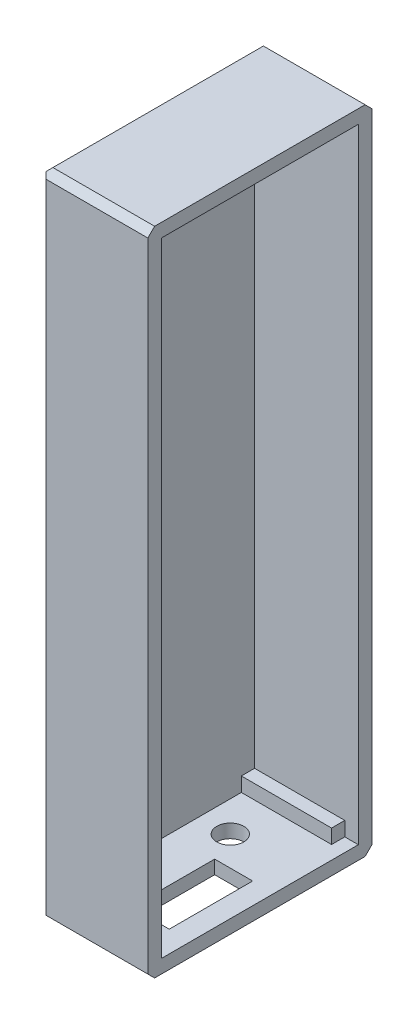
ISO-10303-21;
HEADER;
FILE_DESCRIPTION(('STEP AP214'),'2;1');
FILE_NAME('part.step','',(''),(''),'','','');
FILE_SCHEMA(('AUTOMOTIVE_DESIGN { 1 0 10303 214 1 1 1 1 }'));
ENDSEC;
DATA;
#1=APPLICATION_CONTEXT('core data for automotive mechanical design processes');
#2=APPLICATION_PROTOCOL_DEFINITION('international standard','automotive_design',2000,#1);
#3=PRODUCT_CONTEXT('',#1,'mechanical');
#4=PRODUCT('Part','Part','',(#3));
#5=PRODUCT_RELATED_PRODUCT_CATEGORY('part','',(#4));
#6=PRODUCT_DEFINITION_FORMATION('','',#4);
#7=PRODUCT_DEFINITION_CONTEXT('part definition',#1,'design');
#8=PRODUCT_DEFINITION('design','',#6,#7);
#9=PRODUCT_DEFINITION_SHAPE('','',#8);
#10=(LENGTH_UNIT() NAMED_UNIT(*) SI_UNIT(.MILLI.,.METRE.));
#11=(NAMED_UNIT(*) PLANE_ANGLE_UNIT() SI_UNIT($,.RADIAN.));
#12=(NAMED_UNIT(*) SI_UNIT($,.STERADIAN.) SOLID_ANGLE_UNIT());
#13=UNCERTAINTY_MEASURE_WITH_UNIT(LENGTH_MEASURE(1.E-05),#10,'distance_accuracy_value','');
#14=(GEOMETRIC_REPRESENTATION_CONTEXT(3) GLOBAL_UNCERTAINTY_ASSIGNED_CONTEXT((#13)) GLOBAL_UNIT_ASSIGNED_CONTEXT((#10,
#11,#12)) REPRESENTATION_CONTEXT('',''));
#15=CARTESIAN_POINT('',(0.,0.,0.));
#16=DIRECTION('',(0.,0.,1.));
#17=DIRECTION('',(1.,0.,0.));
#18=AXIS2_PLACEMENT_3D('',#15,#16,#17);
#19=CARTESIAN_POINT('',(-40.5,21.2128324188906,-18.7219563665642));
#20=DIRECTION('',(0.,0.,1.));
#21=DIRECTION('',(1.,0.,0.));
#22=AXIS2_PLACEMENT_3D('',#19,#20,#21);
#23=PLANE('',#22);
#24=DIRECTION('',(0.,1.,0.));
#25=VECTOR('',#24,1.);
#26=CARTESIAN_POINT('',(-26.5,98.4263697766396,-18.7219563665642));
#27=LINE('',#26,#25);
#28=CARTESIAN_POINT('',(-26.5,113.42636977664,-18.7219563665642));
#29=VERTEX_POINT('',#28);
#30=CARTESIAN_POINT('',(-26.5,115.212832418891,-18.7219563665642));
#31=VERTEX_POINT('',#30);
#32=EDGE_CURVE('E165',#29,#31,#27,.T.);
#33=ORIENTED_EDGE('',*,*,#32,.F.);
#34=DIRECTION('',(1.,0.,0.));
#35=VECTOR('',#34,1.);
#36=CARTESIAN_POINT('',(-39.5,113.42636977664,-18.7219563665642));
#37=LINE('',#36,#35);
#38=CARTESIAN_POINT('',(-39.7992713776096,113.42636977664,-18.7219563665642));
#39=VERTEX_POINT('',#38);
#40=EDGE_CURVE('E330',#39,#29,#37,.T.);
#41=ORIENTED_EDGE('',*,*,#40,.F.);
#42=DIRECTION('',(0.,-1.,0.));
#43=VECTOR('',#42,1.);
#44=CARTESIAN_POINT('',(-39.7992713776096,5.18456447563127,-18.7219563665642));
#45=LINE('',#44,#43);
#46=CARTESIAN_POINT('',(-39.7992713776096,25.3196112532839,-18.7219563665642));
#47=VERTEX_POINT('',#46);
#48=EDGE_CURVE('E263',#39,#47,#45,.T.);
#49=ORIENTED_EDGE('',*,*,#48,.T.);
#50=DIRECTION('',(1.,0.,0.));
#51=VECTOR('',#50,1.);
#52=CARTESIAN_POINT('',(-39.5,25.3196112532839,-18.7219563665642));
#53=LINE('',#52,#51);
#54=CARTESIAN_POINT('',(-26.5,25.3196112532839,-18.7219563665642));
#55=VERTEX_POINT('',#54);
#56=EDGE_CURVE('E270',#47,#55,#53,.T.);
#57=ORIENTED_EDGE('',*,*,#56,.T.);
#58=DIRECTION('',(0.,1.,0.));
#59=VECTOR('',#58,1.);
#60=CARTESIAN_POINT('',(-26.5,23.2128324188906,-18.7219563665642));
#61=LINE('',#60,#59);
#62=CARTESIAN_POINT('',(-26.5,23.2128324188906,-18.7219563665642));
#63=VERTEX_POINT('',#62);
#64=EDGE_CURVE('E484',#63,#55,#61,.T.);
#65=ORIENTED_EDGE('',*,*,#64,.F.);
#66=DIRECTION('',(1.,0.,0.));
#67=VECTOR('',#66,1.);
#68=CARTESIAN_POINT('',(-40.5,23.2128324188906,-18.7219563665642));
#69=LINE('',#68,#67);
#70=CARTESIAN_POINT('',(-24.5,23.2128324188906,-18.7219563665642));
#71=VERTEX_POINT('',#70);
#72=EDGE_CURVE('E431',#63,#71,#69,.T.);
#73=ORIENTED_EDGE('',*,*,#72,.T.);
#74=DIRECTION('',(0.,-1.,0.));
#75=VECTOR('',#74,1.);
#76=CARTESIAN_POINT('',(-24.5,5.18456447563127,-18.7219563665642));
#77=LINE('',#76,#75);
#78=CARTESIAN_POINT('',(-24.5,115.212832418891,-18.7219563665642));
#79=VERTEX_POINT('',#78);
#80=EDGE_CURVE('E381',#79,#71,#77,.T.);
#81=ORIENTED_EDGE('',*,*,#80,.F.);
#82=DIRECTION('',(1.,0.,0.));
#83=VECTOR('',#82,1.);
#84=CARTESIAN_POINT('',(-40.5,115.212832418891,-18.7219563665642));
#85=LINE('',#84,#83);
#86=EDGE_CURVE('E292',#31,#79,#85,.T.);
#87=ORIENTED_EDGE('',*,*,#86,.F.);
#88=EDGE_LOOP('',(#33,#41,#49,#57,#65,#73,#81,#87));
#89=FACE_BOUND('',#88,.T.);
#90=ADVANCED_FACE('F83',(#89),#23,.T.);
#91=CARTESIAN_POINT('',(-40.5,115.212832418891,-20.7219563665642));
#92=DIRECTION('',(0.,-1.,0.));
#93=DIRECTION('',(0.,0.,-1.));
#94=AXIS2_PLACEMENT_3D('',#91,#92,#93);
#95=PLANE('',#94);
#96=DIRECTION('',(0.,0.,1.));
#97=VECTOR('',#96,1.);
#98=CARTESIAN_POINT('',(-26.5,115.212832418891,-18.7219563665642));
#99=LINE('',#98,#97);
#100=CARTESIAN_POINT('',(-26.5,115.212832418891,-16.7734714231343));
#101=VERTEX_POINT('',#100);
#102=EDGE_CURVE('E299',#31,#101,#99,.T.);
#103=ORIENTED_EDGE('',*,*,#102,.F.);
#104=ORIENTED_EDGE('',*,*,#86,.T.);
#105=DIRECTION('',(0.,0.,-1.));
#106=VECTOR('',#105,1.);
#107=CARTESIAN_POINT('',(-24.5,115.212832418891,-4.2490717029152));
#108=LINE('',#107,#106);
#109=CARTESIAN_POINT('',(-24.5,115.212832418891,10.3180436334358));
#110=VERTEX_POINT('',#109);
#111=EDGE_CURVE('E266',#110,#79,#108,.T.);
#112=ORIENTED_EDGE('',*,*,#111,.F.);
#113=DIRECTION('',(1.,0.,0.));
#114=VECTOR('',#113,1.);
#115=CARTESIAN_POINT('',(-40.5,115.212832418891,10.3180436334358));
#116=LINE('',#115,#114);
#117=CARTESIAN_POINT('',(-26.5,115.212832418891,10.3180436334358));
#118=VERTEX_POINT('',#117);
#119=EDGE_CURVE('E343',#118,#110,#116,.T.);
#120=ORIENTED_EDGE('',*,*,#119,.F.);
#121=DIRECTION('',(0.,0.,1.));
#122=VECTOR('',#121,1.);
#123=CARTESIAN_POINT('',(-26.5,115.212832418891,10.3180436334358));
#124=LINE('',#123,#122);
#125=CARTESIAN_POINT('',(-26.5,115.212832418891,8.369558690006));
#126=VERTEX_POINT('',#125);
#127=EDGE_CURVE('E339',#126,#118,#124,.T.);
#128=ORIENTED_EDGE('',*,*,#127,.F.);
#129=DIRECTION('',(1.,0.,0.));
#130=VECTOR('',#129,1.);
#131=CARTESIAN_POINT('',(-39.5,115.212832418891,8.369558690006));
#132=LINE('',#131,#130);
#133=CARTESIAN_POINT('',(-39.7992713776096,115.212832418891,8.369558690006));
#134=VERTEX_POINT('',#133);
#135=EDGE_CURVE('E326',#134,#126,#132,.T.);
#136=ORIENTED_EDGE('',*,*,#135,.F.);
#137=DIRECTION('',(0.,0.,-1.));
#138=VECTOR('',#137,1.);
#139=CARTESIAN_POINT('',(-39.7992713776096,115.212832418891,-4.2490717029152));
#140=LINE('',#139,#138);
#141=CARTESIAN_POINT('',(-39.7992713776096,115.212832418891,-16.7734714231343));
#142=VERTEX_POINT('',#141);
#143=EDGE_CURVE('E285',#134,#142,#140,.T.);
#144=ORIENTED_EDGE('',*,*,#143,.T.);
#145=DIRECTION('',(1.,0.,0.));
#146=VECTOR('',#145,1.);
#147=CARTESIAN_POINT('',(-39.5,115.212832418891,-16.7734714231343));
#148=LINE('',#147,#146);
#149=EDGE_CURVE('E329',#142,#101,#148,.T.);
#150=ORIENTED_EDGE('',*,*,#149,.T.);
#151=EDGE_LOOP('',(#103,#104,#112,#120,#128,#136,#144,#150));
#152=FACE_BOUND('',#151,.T.);
#153=ADVANCED_FACE('F568',(#152),#95,.T.);
#154=CARTESIAN_POINT('',(-40.5,23.2128324188906,-20.7219563665642));
#155=DIRECTION('',(0.,1.,0.));
#156=DIRECTION('',(0.,0.,1.));
#157=AXIS2_PLACEMENT_3D('',#154,#155,#156);
#158=PLANE('',#157);
#159=DIRECTION('',(1.,0.,0.));
#160=VECTOR('',#159,1.);
#161=CARTESIAN_POINT('',(-42.364278762556,23.2128324188906,6.00519514922583));
#162=LINE('',#161,#160);
#163=CARTESIAN_POINT('',(-33.2588268817087,23.2128324188906,6.00519514922583));
#164=VERTEX_POINT('',#163);
#165=CARTESIAN_POINT('',(-27.6588268817087,23.2128324188906,6.00519514922583));
#166=VERTEX_POINT('',#165);
#167=EDGE_CURVE('E361',#164,#166,#162,.T.);
#168=ORIENTED_EDGE('',*,*,#167,.F.);
#169=DIRECTION('',(0.,0.,1.));
#170=VECTOR('',#169,1.);
#171=CARTESIAN_POINT('',(-33.2588268817087,23.2128324188906,-19.8403777599721));
#172=LINE('',#171,#170);
#173=CARTESIAN_POINT('',(-33.2588268817087,23.2128324188906,-6.29480485077417));
#174=VERTEX_POINT('',#173);
#175=EDGE_CURVE('E313',#174,#164,#172,.T.);
#176=ORIENTED_EDGE('',*,*,#175,.F.);
#177=DIRECTION('',(-1.,0.,0.));
#178=VECTOR('',#177,1.);
#179=CARTESIAN_POINT('',(-42.364278762556,23.2128324188906,-6.29480485077417));
#180=LINE('',#179,#178);
#181=CARTESIAN_POINT('',(-27.6588268817087,23.2128324188906,-6.29480485077417));
#182=VERTEX_POINT('',#181);
#183=EDGE_CURVE('E353',#182,#174,#180,.T.);
#184=ORIENTED_EDGE('',*,*,#183,.F.);
#185=DIRECTION('',(0.,0.,-1.));
#186=VECTOR('',#185,1.);
#187=CARTESIAN_POINT('',(-27.6588268817087,23.2128324188906,-19.8403777599721));
#188=LINE('',#187,#186);
#189=EDGE_CURVE('E359',#166,#182,#188,.T.);
#190=ORIENTED_EDGE('',*,*,#189,.F.);
#191=EDGE_LOOP('',(#168,#176,#184,#190));
#192=FACE_BOUND('',#191,.T.);
#193=CARTESIAN_POINT('',(-35.2935806759241,23.2128324188906,-10.6333919773061));
#194=DIRECTION('',(0.,1.,0.));
#195=DIRECTION('',(0.,0.,1.));
#196=AXIS2_PLACEMENT_3D('',#193,#194,#195);
#197=CIRCLE('',#196,2.);
#198=CARTESIAN_POINT('',(-35.2935806759241,23.2128324188906,-8.63339197730609));
#199=VERTEX_POINT('',#198);
#200=EDGE_CURVE('E380',#199,#199,#197,.T.);
#201=ORIENTED_EDGE('',*,*,#200,.F.);
#202=EDGE_LOOP('',(#201));
#203=FACE_BOUND('',#202,.T.);
#204=DIRECTION('',(0.,0.,-1.));
#205=VECTOR('',#204,1.);
#206=CARTESIAN_POINT('',(-26.5,23.2128324188906,-16.7734714231343));
#207=LINE('',#206,#205);
#208=CARTESIAN_POINT('',(-26.5,23.2128324188906,-16.7734714231343));
#209=VERTEX_POINT('',#208);
#210=EDGE_CURVE('E493',#209,#63,#207,.T.);
#211=ORIENTED_EDGE('',*,*,#210,.F.);
#212=DIRECTION('',(1.,0.,0.));
#213=VECTOR('',#212,1.);
#214=CARTESIAN_POINT('',(-39.5,23.2128324188906,-16.7734714231343));
#215=LINE('',#214,#213);
#216=CARTESIAN_POINT('',(-39.7992713776096,23.2128324188906,-16.7734714231343));
#217=VERTEX_POINT('',#216);
#218=EDGE_CURVE('E485',#217,#209,#215,.T.);
#219=ORIENTED_EDGE('',*,*,#218,.F.);
#220=DIRECTION('',(0.,0.,1.));
#221=VECTOR('',#220,1.);
#222=CARTESIAN_POINT('',(-39.7992713776096,23.2128324188906,-4.2490717029152));
#223=LINE('',#222,#221);
#224=CARTESIAN_POINT('',(-39.7992713776096,23.2128324188906,8.369558690006));
#225=VERTEX_POINT('',#224);
#226=EDGE_CURVE('E265',#217,#225,#223,.T.);
#227=ORIENTED_EDGE('',*,*,#226,.T.);
#228=DIRECTION('',(1.,0.,0.));
#229=VECTOR('',#228,1.);
#230=CARTESIAN_POINT('',(-39.5,23.2128324188906,8.369558690006));
#231=LINE('',#230,#229);
#232=CARTESIAN_POINT('',(-26.5,23.2128324188906,8.369558690006));
#233=VERTEX_POINT('',#232);
#234=EDGE_CURVE('E262',#225,#233,#231,.T.);
#235=ORIENTED_EDGE('',*,*,#234,.T.);
#236=DIRECTION('',(0.,0.,-1.));
#237=VECTOR('',#236,1.);
#238=CARTESIAN_POINT('',(-26.5,23.2128324188906,8.369558690006));
#239=LINE('',#238,#237);
#240=CARTESIAN_POINT('',(-26.5,23.2128324188906,10.3180436334358));
#241=VERTEX_POINT('',#240);
#242=EDGE_CURVE('E1010',#241,#233,#239,.T.);
#243=ORIENTED_EDGE('',*,*,#242,.F.);
#244=DIRECTION('',(1.,0.,0.));
#245=VECTOR('',#244,1.);
#246=CARTESIAN_POINT('',(-40.5,23.2128324188906,10.3180436334358));
#247=LINE('',#246,#245);
#248=CARTESIAN_POINT('',(-24.5,23.2128324188906,10.3180436334358));
#249=VERTEX_POINT('',#248);
#250=EDGE_CURVE('E346',#241,#249,#247,.T.);
#251=ORIENTED_EDGE('',*,*,#250,.T.);
#252=DIRECTION('',(0.,0.,1.));
#253=VECTOR('',#252,1.);
#254=CARTESIAN_POINT('',(-24.5,23.2128324188906,-4.2490717029152));
#255=LINE('',#254,#253);
#256=EDGE_CURVE('E438',#71,#249,#255,.T.);
#257=ORIENTED_EDGE('',*,*,#256,.F.);
#258=ORIENTED_EDGE('',*,*,#72,.F.);
#259=EDGE_LOOP('',(#211,#219,#227,#235,#243,#251,#257,#258));
#260=FACE_BOUND('',#259,.T.);
#261=ADVANCED_FACE('F509',(#192,#203,#260),#158,.T.);
#262=CARTESIAN_POINT('',(-24.5,5.18456447563127,-4.2490717029152));
#263=DIRECTION('',(1.,0.,0.));
#264=DIRECTION('',(0.,0.,-1.));
#265=AXIS2_PLACEMENT_3D('',#262,#263,#264);
#266=PLANE('',#265);
#267=DIRECTION('',(0.,0.,-1.));
#268=VECTOR('',#267,1.);
#269=CARTESIAN_POINT('',(-24.5,117.212832418891,-20.7219563665642));
#270=LINE('',#269,#268);
#271=CARTESIAN_POINT('',(-24.5,117.212832418891,11.3180436334358));
#272=VERTEX_POINT('',#271);
#273=CARTESIAN_POINT('',(-24.5,117.212832418891,-19.7219563665642));
#274=VERTEX_POINT('',#273);
#275=EDGE_CURVE('E310',#272,#274,#270,.T.);
#276=ORIENTED_EDGE('',*,*,#275,.F.);
#277=DIRECTION('',(0.,0.707106781186552,-0.707106781186543));
#278=VECTOR('',#277,1.);
#279=CARTESIAN_POINT('',(-24.5,68.9822561154357,59.5486199368901));
#280=LINE('',#279,#278);
#281=CARTESIAN_POINT('',(-24.5,116.212832418891,12.3180436334358));
#282=VERTEX_POINT('',#281);
#283=EDGE_CURVE('E388',#272,#282,#280,.F.);
#284=ORIENTED_EDGE('',*,*,#283,.T.);
#285=DIRECTION('',(0.,1.,0.));
#286=VECTOR('',#285,1.);
#287=CARTESIAN_POINT('',(-24.5,21.2128324188906,12.3180436334358));
#288=LINE('',#287,#286);
#289=CARTESIAN_POINT('',(-24.5,22.2128324188906,12.3180436334358));
#290=VERTEX_POINT('',#289);
#291=EDGE_CURVE('E314',#290,#282,#288,.T.);
#292=ORIENTED_EDGE('',*,*,#291,.F.);
#293=DIRECTION('',(0.,0.707106781186548,0.707106781186548));
#294=VECTOR('',#293,1.);
#295=CARTESIAN_POINT('',(-24.5,5.41514077908542,-4.47964800636934));
#296=LINE('',#295,#294);
#297=CARTESIAN_POINT('',(-24.5,21.2128324188906,11.3180436334358));
#298=VERTEX_POINT('',#297);
#299=EDGE_CURVE('E453',#290,#298,#296,.F.);
#300=ORIENTED_EDGE('',*,*,#299,.T.);
#301=DIRECTION('',(0.,0.,1.));
#302=VECTOR('',#301,1.);
#303=CARTESIAN_POINT('',(-24.5,21.2128324188906,-20.7219563665642));
#304=LINE('',#303,#302);
#305=CARTESIAN_POINT('',(-24.5,21.2128324188906,-19.7219563665642));
#306=VERTEX_POINT('',#305);
#307=EDGE_CURVE('E430',#306,#298,#304,.T.);
#308=ORIENTED_EDGE('',*,*,#307,.F.);
#309=DIRECTION('',(0.,-0.707106781186548,0.707106781186548));
#310=VECTOR('',#309,1.);
#311=CARTESIAN_POINT('',(-24.5,5.46225611543645,-3.97138006311002));
#312=LINE('',#311,#310);
#313=CARTESIAN_POINT('',(-24.5,22.2128324188906,-20.7219563665642));
#314=VERTEX_POINT('',#313);
#315=EDGE_CURVE('E429',#306,#314,#312,.F.);
#316=ORIENTED_EDGE('',*,*,#315,.T.);
#317=DIRECTION('',(0.,-1.,0.));
#318=VECTOR('',#317,1.);
#319=CARTESIAN_POINT('',(-24.5,21.2128324188906,-20.7219563665642));
#320=LINE('',#319,#318);
#321=CARTESIAN_POINT('',(-24.5,116.212832418891,-20.7219563665642));
#322=VERTEX_POINT('',#321);
#323=EDGE_CURVE('E425',#322,#314,#320,.T.);
#324=ORIENTED_EDGE('',*,*,#323,.F.);
#325=DIRECTION('',(0.,-0.707106781186552,-0.707106781186543));
#326=VECTOR('',#325,1.);
#327=CARTESIAN_POINT('',(-24.5,68.9351407790846,-67.9996480063694));
#328=LINE('',#327,#326);
#329=EDGE_CURVE('E249',#322,#274,#328,.F.);
#330=ORIENTED_EDGE('',*,*,#329,.T.);
#331=EDGE_LOOP('',(#276,#284,#292,#300,#308,#316,#324,#330));
#332=FACE_BOUND('',#331,.T.);
#333=ORIENTED_EDGE('',*,*,#111,.T.);
#334=ORIENTED_EDGE('',*,*,#80,.T.);
#335=ORIENTED_EDGE('',*,*,#256,.T.);
#336=DIRECTION('',(0.,1.,0.));
#337=VECTOR('',#336,1.);
#338=CARTESIAN_POINT('',(-24.5,5.18456447563127,10.3180436334358));
#339=LINE('',#338,#337);
#340=EDGE_CURVE('E349',#249,#110,#339,.T.);
#341=ORIENTED_EDGE('',*,*,#340,.T.);
#342=EDGE_LOOP('',(#333,#334,#335,#341));
#343=FACE_BOUND('',#342,.T.);
#344=ADVANCED_FACE('F420',(#332,#343),#266,.T.);
#345=CARTESIAN_POINT('',(-40.5,21.2128324188906,-20.7219563665642));
#346=DIRECTION('',(0.,0.,1.));
#347=DIRECTION('',(1.,0.,0.));
#348=AXIS2_PLACEMENT_3D('',#345,#346,#347);
#349=PLANE('',#348);
#350=DIRECTION('',(0.,1.,0.));
#351=VECTOR('',#350,1.);
#352=CARTESIAN_POINT('',(-39.5,21.2128324188906,-20.7219563665642));
#353=LINE('',#352,#351);
#354=CARTESIAN_POINT('',(-39.5,22.2128324188906,-20.7219563665642));
#355=VERTEX_POINT('',#354);
#356=CARTESIAN_POINT('',(-39.5,116.212832418891,-20.7219563665642));
#357=VERTEX_POINT('',#356);
#358=EDGE_CURVE('E229',#355,#357,#353,.T.);
#359=ORIENTED_EDGE('',*,*,#358,.T.);
#360=DIRECTION('',(1.,0.,0.));
#361=VECTOR('',#360,1.);
#362=CARTESIAN_POINT('',(-40.5,116.212832418891,-20.7219563665642));
#363=LINE('',#362,#361);
#364=EDGE_CURVE('E240',#357,#322,#363,.T.);
#365=ORIENTED_EDGE('',*,*,#364,.T.);
#366=ORIENTED_EDGE('',*,*,#323,.T.);
#367=DIRECTION('',(-1.,0.,0.));
#368=VECTOR('',#367,1.);
#369=CARTESIAN_POINT('',(-40.5,22.2128324188906,-20.7219563665642));
#370=LINE('',#369,#368);
#371=EDGE_CURVE('E243',#314,#355,#370,.T.);
#372=ORIENTED_EDGE('',*,*,#371,.T.);
#373=EDGE_LOOP('',(#359,#365,#366,#372));
#374=FACE_BOUND('',#373,.T.);
#375=ADVANCED_FACE('F238',(#374),#349,.F.);
#376=CARTESIAN_POINT('',(-40.5,21.2128324188906,-20.7219563665642));
#377=DIRECTION('',(0.,1.,0.));
#378=DIRECTION('',(0.,0.,1.));
#379=AXIS2_PLACEMENT_3D('',#376,#377,#378);
#380=PLANE('',#379);
#381=CARTESIAN_POINT('',(-35.2935806759241,21.2128324188906,-10.6333919773061));
#382=DIRECTION('',(0.,-1.,0.));
#383=DIRECTION('',(0.,0.,-1.));
#384=AXIS2_PLACEMENT_3D('',#381,#382,#383);
#385=CIRCLE('',#384,2.);
#386=CARTESIAN_POINT('',(-35.2935806759241,21.2128324188906,-12.6333919773061));
#387=VERTEX_POINT('',#386);
#388=EDGE_CURVE('E444',#387,#387,#385,.T.);
#389=ORIENTED_EDGE('',*,*,#388,.F.);
#390=EDGE_LOOP('',(#389));
#391=FACE_BOUND('',#390,.T.);
#392=DIRECTION('',(0.,0.,-1.));
#393=VECTOR('',#392,1.);
#394=CARTESIAN_POINT('',(-33.2588268817087,21.2128324188906,-4.73600073532048));
#395=LINE('',#394,#393);
#396=CARTESIAN_POINT('',(-33.2588268817087,21.2128324188906,6.00519514922583));
#397=VERTEX_POINT('',#396);
#398=CARTESIAN_POINT('',(-33.2588268817087,21.2128324188906,-6.29480485077417));
#399=VERTEX_POINT('',#398);
#400=EDGE_CURVE('E354',#397,#399,#395,.T.);
#401=ORIENTED_EDGE('',*,*,#400,.F.);
#402=DIRECTION('',(-1.,0.,0.));
#403=VECTOR('',#402,1.);
#404=CARTESIAN_POINT('',(-36.545606228137,21.2128324188906,6.00519514922583));
#405=LINE('',#404,#403);
#406=CARTESIAN_POINT('',(-27.6588268817087,21.2128324188906,6.00519514922583));
#407=VERTEX_POINT('',#406);
#408=EDGE_CURVE('E358',#407,#397,#405,.T.);
#409=ORIENTED_EDGE('',*,*,#408,.F.);
#410=DIRECTION('',(0.,0.,1.));
#411=VECTOR('',#410,1.);
#412=CARTESIAN_POINT('',(-27.6588268817087,21.2128324188906,3.46399926467952));
#413=LINE('',#412,#411);
#414=CARTESIAN_POINT('',(-27.6588268817087,21.2128324188906,-6.29480485077417));
#415=VERTEX_POINT('',#414);
#416=EDGE_CURVE('E362',#415,#407,#413,.T.);
#417=ORIENTED_EDGE('',*,*,#416,.F.);
#418=DIRECTION('',(1.,0.,0.));
#419=VECTOR('',#418,1.);
#420=CARTESIAN_POINT('',(-33.245606228137,21.2128324188906,-6.29480485077417));
#421=LINE('',#420,#419);
#422=EDGE_CURVE('E357',#399,#415,#421,.T.);
#423=ORIENTED_EDGE('',*,*,#422,.F.);
#424=EDGE_LOOP('',(#401,#409,#417,#423));
#425=FACE_BOUND('',#424,.T.);
#426=ORIENTED_EDGE('',*,*,#307,.T.);
#427=DIRECTION('',(-1.,0.,0.));
#428=VECTOR('',#427,1.);
#429=CARTESIAN_POINT('',(-40.5,21.2128324188906,11.3180436334358));
#430=LINE('',#429,#428);
#431=CARTESIAN_POINT('',(-39.5,21.2128324188906,11.3180436334358));
#432=VERTEX_POINT('',#431);
#433=EDGE_CURVE('E244',#298,#432,#430,.T.);
#434=ORIENTED_EDGE('',*,*,#433,.T.);
#435=DIRECTION('',(0.,0.,-1.));
#436=VECTOR('',#435,1.);
#437=CARTESIAN_POINT('',(-39.5,21.2128324188906,-20.7219563665642));
#438=LINE('',#437,#436);
#439=CARTESIAN_POINT('',(-39.5,21.2128324188906,-19.7219563665642));
#440=VERTEX_POINT('',#439);
#441=EDGE_CURVE('E459',#432,#440,#438,.T.);
#442=ORIENTED_EDGE('',*,*,#441,.T.);
#443=DIRECTION('',(1.,0.,0.));
#444=VECTOR('',#443,1.);
#445=CARTESIAN_POINT('',(-40.5,21.2128324188906,-19.7219563665642));
#446=LINE('',#445,#444);
#447=EDGE_CURVE('E456',#440,#306,#446,.T.);
#448=ORIENTED_EDGE('',*,*,#447,.T.);
#449=EDGE_LOOP('',(#426,#434,#442,#448));
#450=FACE_BOUND('',#449,.T.);
#451=ADVANCED_FACE('F626',(#391,#425,#450),#380,.F.);
#452=CARTESIAN_POINT('',(-40.5,21.2128324188906,12.3180436334358));
#453=DIRECTION('',(0.,0.,-1.));
#454=DIRECTION('',(-1.,0.,0.));
#455=AXIS2_PLACEMENT_3D('',#452,#453,#454);
#456=PLANE('',#455);
#457=ORIENTED_EDGE('',*,*,#291,.T.);
#458=DIRECTION('',(-1.,0.,0.));
#459=VECTOR('',#458,1.);
#460=CARTESIAN_POINT('',(-40.5,116.212832418891,12.3180436334358));
#461=LINE('',#460,#459);
#462=CARTESIAN_POINT('',(-39.5,116.212832418891,12.3180436334358));
#463=VERTEX_POINT('',#462);
#464=EDGE_CURVE('E390',#282,#463,#461,.T.);
#465=ORIENTED_EDGE('',*,*,#464,.T.);
#466=DIRECTION('',(0.,-1.,0.));
#467=VECTOR('',#466,1.);
#468=CARTESIAN_POINT('',(-39.5,21.2128324188906,12.3180436334358));
#469=LINE('',#468,#467);
#470=CARTESIAN_POINT('',(-39.5,22.2128324188906,12.3180436334358));
#471=VERTEX_POINT('',#470);
#472=EDGE_CURVE('E449',#463,#471,#469,.T.);
#473=ORIENTED_EDGE('',*,*,#472,.T.);
#474=DIRECTION('',(1.,0.,0.));
#475=VECTOR('',#474,1.);
#476=CARTESIAN_POINT('',(-40.5,22.2128324188906,12.3180436334358));
#477=LINE('',#476,#475);
#478=EDGE_CURVE('E411',#471,#290,#477,.T.);
#479=ORIENTED_EDGE('',*,*,#478,.T.);
#480=EDGE_LOOP('',(#457,#465,#473,#479));
#481=FACE_BOUND('',#480,.T.);
#482=ADVANCED_FACE('F623',(#481),#456,.F.);
#483=CARTESIAN_POINT('',(-40.5,117.212832418891,-20.7219563665642));
#484=DIRECTION('',(0.,-1.,0.));
#485=DIRECTION('',(0.,0.,-1.));
#486=AXIS2_PLACEMENT_3D('',#483,#484,#485);
#487=PLANE('',#486);
#488=DIRECTION('',(0.,0.,1.));
#489=VECTOR('',#488,1.);
#490=CARTESIAN_POINT('',(-39.5,117.212832418891,-20.7219563665642));
#491=LINE('',#490,#489);
#492=CARTESIAN_POINT('',(-39.5,117.212832418891,-19.7219563665642));
#493=VERTEX_POINT('',#492);
#494=CARTESIAN_POINT('',(-39.5,117.212832418891,11.3180436334358));
#495=VERTEX_POINT('',#494);
#496=EDGE_CURVE('E293',#493,#495,#491,.T.);
#497=ORIENTED_EDGE('',*,*,#496,.T.);
#498=DIRECTION('',(1.,0.,0.));
#499=VECTOR('',#498,1.);
#500=CARTESIAN_POINT('',(-40.5,117.212832418891,11.3180436334358));
#501=LINE('',#500,#499);
#502=EDGE_CURVE('E384',#495,#272,#501,.T.);
#503=ORIENTED_EDGE('',*,*,#502,.T.);
#504=ORIENTED_EDGE('',*,*,#275,.T.);
#505=DIRECTION('',(-1.,0.,0.));
#506=VECTOR('',#505,1.);
#507=CARTESIAN_POINT('',(-40.5,117.212832418891,-19.7219563665642));
#508=LINE('',#507,#506);
#509=EDGE_CURVE('E297',#274,#493,#508,.T.);
#510=ORIENTED_EDGE('',*,*,#509,.T.);
#511=EDGE_LOOP('',(#497,#503,#504,#510));
#512=FACE_BOUND('',#511,.T.);
#513=ADVANCED_FACE('F416',(#512),#487,.F.);
#514=CARTESIAN_POINT('',(-40.5,5.18456447563127,-4.2490717029152));
#515=DIRECTION('',(1.,0.,0.));
#516=DIRECTION('',(0.,0.,-1.));
#517=AXIS2_PLACEMENT_3D('',#514,#515,#516);
#518=PLANE('',#517);
#519=DIRECTION('',(0.,1.,0.));
#520=VECTOR('',#519,1.);
#521=CARTESIAN_POINT('',(-40.5,5.18456447563127,11.3180436334358));
#522=LINE('',#521,#520);
#523=CARTESIAN_POINT('',(-40.5,22.2128324188906,11.3180436334358));
#524=VERTEX_POINT('',#523);
#525=CARTESIAN_POINT('',(-40.5,116.212832418891,11.3180436334358));
#526=VERTEX_POINT('',#525);
#527=EDGE_CURVE('E399',#524,#526,#522,.T.);
#528=ORIENTED_EDGE('',*,*,#527,.T.);
#529=DIRECTION('',(0.,0.,-1.));
#530=VECTOR('',#529,1.);
#531=CARTESIAN_POINT('',(-40.5,116.212832418891,-4.2490717029152));
#532=LINE('',#531,#530);
#533=CARTESIAN_POINT('',(-40.5,116.212832418891,-19.7219563665642));
#534=VERTEX_POINT('',#533);
#535=EDGE_CURVE('E12',#526,#534,#532,.T.);
#536=ORIENTED_EDGE('',*,*,#535,.T.);
#537=DIRECTION('',(0.,-1.,0.));
#538=VECTOR('',#537,1.);
#539=CARTESIAN_POINT('',(-40.5,5.18456447563127,-19.7219563665642));
#540=LINE('',#539,#538);
#541=CARTESIAN_POINT('',(-40.5,22.2128324188906,-19.7219563665642));
#542=VERTEX_POINT('',#541);
#543=EDGE_CURVE('E376',#534,#542,#540,.T.);
#544=ORIENTED_EDGE('',*,*,#543,.T.);
#545=DIRECTION('',(0.,0.,1.));
#546=VECTOR('',#545,1.);
#547=CARTESIAN_POINT('',(-40.5,22.2128324188906,-4.2490717029152));
#548=LINE('',#547,#546);
#549=EDGE_CURVE('E409',#542,#524,#548,.T.);
#550=ORIENTED_EDGE('',*,*,#549,.T.);
#551=EDGE_LOOP('',(#528,#536,#544,#550));
#552=FACE_BOUND('',#551,.T.);
#553=ADVANCED_FACE('F406',(#552),#518,.F.);
#554=CARTESIAN_POINT('',(-40.5,21.2128324188906,10.3180436334358));
#555=DIRECTION('',(0.,0.,-1.));
#556=DIRECTION('',(-1.,0.,0.));
#557=AXIS2_PLACEMENT_3D('',#554,#555,#556);
#558=PLANE('',#557);
#559=DIRECTION('',(0.,-1.,0.));
#560=VECTOR('',#559,1.);
#561=CARTESIAN_POINT('',(-26.5,23.2128324188906,10.3180436334358));
#562=LINE('',#561,#560);
#563=CARTESIAN_POINT('',(-26.5,25.3196112532839,10.3180436334358));
#564=VERTEX_POINT('',#563);
#565=EDGE_CURVE('E1014',#564,#241,#562,.T.);
#566=ORIENTED_EDGE('',*,*,#565,.F.);
#567=DIRECTION('',(1.,0.,0.));
#568=VECTOR('',#567,1.);
#569=CARTESIAN_POINT('',(-39.5,25.3196112532839,10.3180436334358));
#570=LINE('',#569,#568);
#571=CARTESIAN_POINT('',(-39.7992713776096,25.3196112532839,10.3180436334358));
#572=VERTEX_POINT('',#571);
#573=EDGE_CURVE('E1022',#572,#564,#570,.T.);
#574=ORIENTED_EDGE('',*,*,#573,.F.);
#575=DIRECTION('',(0.,1.,0.));
#576=VECTOR('',#575,1.);
#577=CARTESIAN_POINT('',(-39.7992713776096,5.18456447563127,10.3180436334358));
#578=LINE('',#577,#576);
#579=CARTESIAN_POINT('',(-39.7992713776096,113.42636977664,10.3180436334358));
#580=VERTEX_POINT('',#579);
#581=EDGE_CURVE('E277',#572,#580,#578,.T.);
#582=ORIENTED_EDGE('',*,*,#581,.T.);
#583=DIRECTION('',(1.,0.,0.));
#584=VECTOR('',#583,1.);
#585=CARTESIAN_POINT('',(-39.5,113.42636977664,10.3180436334358));
#586=LINE('',#585,#584);
#587=CARTESIAN_POINT('',(-26.5,113.42636977664,10.3180436334358));
#588=VERTEX_POINT('',#587);
#589=EDGE_CURVE('E315',#580,#588,#586,.T.);
#590=ORIENTED_EDGE('',*,*,#589,.T.);
#591=DIRECTION('',(0.,-1.,0.));
#592=VECTOR('',#591,1.);
#593=CARTESIAN_POINT('',(-26.5,98.4263697766396,10.3180436334358));
#594=LINE('',#593,#592);
#595=EDGE_CURVE('E323',#118,#588,#594,.T.);
#596=ORIENTED_EDGE('',*,*,#595,.F.);
#597=ORIENTED_EDGE('',*,*,#119,.T.);
#598=ORIENTED_EDGE('',*,*,#340,.F.);
#599=ORIENTED_EDGE('',*,*,#250,.F.);
#600=EDGE_LOOP('',(#566,#574,#582,#590,#596,#597,#598,#599));
#601=FACE_BOUND('',#600,.T.);
#602=ADVANCED_FACE('F560',(#601),#558,.T.);
#603=CARTESIAN_POINT('',(-39.7992713776096,5.18456447563127,-4.2490717029152));
#604=DIRECTION('',(1.,0.,0.));
#605=DIRECTION('',(0.,0.,-1.));
#606=AXIS2_PLACEMENT_3D('',#603,#604,#605);
#607=PLANE('',#606);
#608=ORIENTED_EDGE('',*,*,#48,.F.);
#609=DIRECTION('',(0.,0.,1.));
#610=VECTOR('',#609,1.);
#611=CARTESIAN_POINT('',(-39.7992713776096,113.42636977664,-18.7219563665642));
#612=LINE('',#611,#610);
#613=CARTESIAN_POINT('',(-39.7992713776096,113.42636977664,-16.7734714231343));
#614=VERTEX_POINT('',#613);
#615=EDGE_CURVE('E87',#39,#614,#612,.T.);
#616=ORIENTED_EDGE('',*,*,#615,.T.);
#617=DIRECTION('',(0.,1.,0.));
#618=VECTOR('',#617,1.);
#619=CARTESIAN_POINT('',(-39.7992713776096,100.212832418891,-16.7734714231343));
#620=LINE('',#619,#618);
#621=EDGE_CURVE('E154',#614,#142,#620,.T.);
#622=ORIENTED_EDGE('',*,*,#621,.T.);
#623=ORIENTED_EDGE('',*,*,#143,.F.);
#624=DIRECTION('',(0.,1.,0.));
#625=VECTOR('',#624,1.);
#626=CARTESIAN_POINT('',(-39.7992713776096,5.18456447563127,8.369558690006));
#627=LINE('',#626,#625);
#628=CARTESIAN_POINT('',(-39.7992713776096,113.42636977664,8.369558690006));
#629=VERTEX_POINT('',#628);
#630=EDGE_CURVE('E283',#629,#134,#627,.T.);
#631=ORIENTED_EDGE('',*,*,#630,.F.);
#632=DIRECTION('',(0.,0.,-1.));
#633=VECTOR('',#632,1.);
#634=CARTESIAN_POINT('',(-39.7992713776096,113.42636977664,-4.2490717029152));
#635=LINE('',#634,#633);
#636=EDGE_CURVE('E286',#580,#629,#635,.T.);
#637=ORIENTED_EDGE('',*,*,#636,.F.);
#638=ORIENTED_EDGE('',*,*,#581,.F.);
#639=DIRECTION('',(0.,0.,1.));
#640=VECTOR('',#639,1.);
#641=CARTESIAN_POINT('',(-39.7992713776096,25.3196112532839,-4.24907170291516));
#642=LINE('',#641,#640);
#643=CARTESIAN_POINT('',(-39.7992713776096,25.3196112532839,8.369558690006));
#644=VERTEX_POINT('',#643);
#645=EDGE_CURVE('E280',#644,#572,#642,.T.);
#646=ORIENTED_EDGE('',*,*,#645,.F.);
#647=DIRECTION('',(0.,1.,0.));
#648=VECTOR('',#647,1.);
#649=CARTESIAN_POINT('',(-39.7992713776096,5.18456447563127,8.369558690006));
#650=LINE('',#649,#648);
#651=EDGE_CURVE('E271',#225,#644,#650,.T.);
#652=ORIENTED_EDGE('',*,*,#651,.F.);
#653=ORIENTED_EDGE('',*,*,#226,.F.);
#654=DIRECTION('',(0.,1.,0.));
#655=VECTOR('',#654,1.);
#656=CARTESIAN_POINT('',(-39.7992713776096,25.3196112532839,-16.7734714231343));
#657=LINE('',#656,#655);
#658=CARTESIAN_POINT('',(-39.7992713776096,25.3196112532839,-16.7734714231343));
#659=VERTEX_POINT('',#658);
#660=EDGE_CURVE('E272',#217,#659,#657,.T.);
#661=ORIENTED_EDGE('',*,*,#660,.T.);
#662=DIRECTION('',(0.,0.,-1.));
#663=VECTOR('',#662,1.);
#664=CARTESIAN_POINT('',(-39.7992713776096,25.3196112532839,-18.7219563665642));
#665=LINE('',#664,#663);
#666=EDGE_CURVE('E267',#659,#47,#665,.T.);
#667=ORIENTED_EDGE('',*,*,#666,.T.);
#668=EDGE_LOOP('',(#608,#616,#622,#623,#631,#637,#638,#646,#652,#653,#661,#667));
#669=FACE_BOUND('',#668,.T.);
#670=ADVANCED_FACE('F85',(#669),#607,.T.);
#671=CARTESIAN_POINT('',(-36.545606228137,36.2128324188906,6.00519514922583));
#672=DIRECTION('',(0.,0.,1.));
#673=DIRECTION('',(1.,0.,0.));
#674=AXIS2_PLACEMENT_3D('',#671,#672,#673);
#675=PLANE('',#674);
#676=ORIENTED_EDGE('',*,*,#167,.T.);
#677=DIRECTION('',(0.,-1.,0.));
#678=VECTOR('',#677,1.);
#679=CARTESIAN_POINT('',(-27.6588268817087,36.2128324188906,6.00519514922583));
#680=LINE('',#679,#678);
#681=EDGE_CURVE('E370',#166,#407,#680,.T.);
#682=ORIENTED_EDGE('',*,*,#681,.T.);
#683=ORIENTED_EDGE('',*,*,#408,.T.);
#684=DIRECTION('',(0.,-1.,0.));
#685=VECTOR('',#684,1.);
#686=CARTESIAN_POINT('',(-33.2588268817087,36.2128324188906,6.00519514922583));
#687=LINE('',#686,#685);
#688=EDGE_CURVE('E365',#164,#397,#687,.T.);
#689=ORIENTED_EDGE('',*,*,#688,.F.);
#690=EDGE_LOOP('',(#676,#682,#683,#689));
#691=FACE_BOUND('',#690,.T.);
#692=ADVANCED_FACE('F706',(#691),#675,.F.);
#693=CARTESIAN_POINT('',(-27.6588268817087,36.2128324188906,3.46399926467952));
#694=DIRECTION('',(1.,0.,0.));
#695=DIRECTION('',(0.,0.,-1.));
#696=AXIS2_PLACEMENT_3D('',#693,#694,#695);
#697=PLANE('',#696);
#698=ORIENTED_EDGE('',*,*,#189,.T.);
#699=DIRECTION('',(0.,-1.,0.));
#700=VECTOR('',#699,1.);
#701=CARTESIAN_POINT('',(-27.6588268817087,36.2128324188906,-6.29480485077417));
#702=LINE('',#701,#700);
#703=EDGE_CURVE('E368',#182,#415,#702,.T.);
#704=ORIENTED_EDGE('',*,*,#703,.T.);
#705=ORIENTED_EDGE('',*,*,#416,.T.);
#706=ORIENTED_EDGE('',*,*,#681,.F.);
#707=EDGE_LOOP('',(#698,#704,#705,#706));
#708=FACE_BOUND('',#707,.T.);
#709=ADVANCED_FACE('F736',(#708),#697,.F.);
#710=CARTESIAN_POINT('',(-33.245606228137,36.2128324188906,-6.29480485077417));
#711=DIRECTION('',(0.,0.,-1.));
#712=DIRECTION('',(-1.,0.,0.));
#713=AXIS2_PLACEMENT_3D('',#710,#711,#712);
#714=PLANE('',#713);
#715=ORIENTED_EDGE('',*,*,#183,.T.);
#716=DIRECTION('',(0.,-1.,0.));
#717=VECTOR('',#716,1.);
#718=CARTESIAN_POINT('',(-33.2588268817087,36.2128324188906,-6.29480485077417));
#719=LINE('',#718,#717);
#720=EDGE_CURVE('E371',#174,#399,#719,.T.);
#721=ORIENTED_EDGE('',*,*,#720,.T.);
#722=ORIENTED_EDGE('',*,*,#422,.T.);
#723=ORIENTED_EDGE('',*,*,#703,.F.);
#724=EDGE_LOOP('',(#715,#721,#722,#723));
#725=FACE_BOUND('',#724,.T.);
#726=ADVANCED_FACE('F734',(#725),#714,.F.);
#727=CARTESIAN_POINT('',(-33.2588268817087,36.2128324188906,-4.73600073532048));
#728=DIRECTION('',(-1.,0.,0.));
#729=DIRECTION('',(0.,0.,1.));
#730=AXIS2_PLACEMENT_3D('',#727,#728,#729);
#731=PLANE('',#730);
#732=ORIENTED_EDGE('',*,*,#175,.T.);
#733=ORIENTED_EDGE('',*,*,#688,.T.);
#734=ORIENTED_EDGE('',*,*,#400,.T.);
#735=ORIENTED_EDGE('',*,*,#720,.F.);
#736=EDGE_LOOP('',(#732,#733,#734,#735));
#737=FACE_BOUND('',#736,.T.);
#738=ADVANCED_FACE('F682',(#737),#731,.F.);
#739=CARTESIAN_POINT('',(-35.2935806759241,31.2128324188906,-10.6333919773061));
#740=DIRECTION('',(0.,-1.,0.));
#741=DIRECTION('',(0.,0.,-1.));
#742=AXIS2_PLACEMENT_3D('',#739,#740,#741);
#743=CYLINDRICAL_SURFACE('',#742,2.);
#744=ORIENTED_EDGE('',*,*,#200,.T.);
#745=EDGE_LOOP('',(#744));
#746=FACE_BOUND('',#745,.T.);
#747=ORIENTED_EDGE('',*,*,#388,.T.);
#748=EDGE_LOOP('',(#747));
#749=FACE_BOUND('',#748,.T.);
#750=ADVANCED_FACE('F612',(#746,#749),#743,.F.);
#751=CARTESIAN_POINT('',(-40.5,21.2128324188906,-19.7219563665642));
#752=DIRECTION('',(0.,0.707106781186547,0.707106781186547));
#753=DIRECTION('',(1.,0.,0.));
#754=AXIS2_PLACEMENT_3D('',#751,#752,#753);
#755=PLANE('',#754);
#756=ORIENTED_EDGE('',*,*,#315,.F.);
#757=ORIENTED_EDGE('',*,*,#447,.F.);
#758=DIRECTION('',(0.,0.707106781186547,-0.707106781186547));
#759=VECTOR('',#758,1.);
#760=CARTESIAN_POINT('',(-39.5,21.2128324188906,-19.7219563665642));
#761=LINE('',#760,#759);
#762=EDGE_CURVE('E478',#355,#440,#761,.F.);
#763=ORIENTED_EDGE('',*,*,#762,.F.);
#764=ORIENTED_EDGE('',*,*,#371,.F.);
#765=EDGE_LOOP('',(#756,#757,#763,#764));
#766=FACE_BOUND('',#765,.T.);
#767=ADVANCED_FACE('F674',(#766),#755,.F.);
#768=CARTESIAN_POINT('',(-40.5,5.18456447563127,-19.7219563665642));
#769=DIRECTION('',(0.707106781186547,0.,0.707106781186547));
#770=DIRECTION('',(0.,-1.,0.));
#771=AXIS2_PLACEMENT_3D('',#768,#769,#770);
#772=PLANE('',#771);
#773=DIRECTION('',(0.577350269189623,0.577350269189631,-0.577350269189623));
#774=VECTOR('',#773,1.);
#775=CARTESIAN_POINT('',(-77.5094226477533,79.2034097711368,17.2874662811891));
#776=LINE('',#775,#774);
#777=CARTESIAN_POINT('',(-40.,116.712832418891,-20.2219563665642));
#778=VERTEX_POINT('',#777);
#779=EDGE_CURVE('E102',#534,#778,#776,.T.);
#780=ORIENTED_EDGE('',*,*,#779,.T.);
#781=DIRECTION('',(0.577350269189623,-0.577350269189631,-0.577350269189623));
#782=VECTOR('',#781,1.);
#783=CARTESIAN_POINT('',(-3.15724401891339,79.8700764378035,-57.0647123476508));
#784=LINE('',#783,#782);
#785=EDGE_CURVE('E93',#778,#357,#784,.T.);
#786=ORIENTED_EDGE('',*,*,#785,.T.);
#787=ORIENTED_EDGE('',*,*,#358,.F.);
#788=DIRECTION('',(-0.707106781186547,0.,0.707106781186547));
#789=VECTOR('',#788,1.);
#790=CARTESIAN_POINT('',(-40.,22.2128324188906,-20.2219563665642));
#791=LINE('',#790,#789);
#792=EDGE_CURVE('E475',#542,#355,#791,.F.);
#793=ORIENTED_EDGE('',*,*,#792,.F.);
#794=ORIENTED_EDGE('',*,*,#543,.F.);
#795=EDGE_LOOP('',(#780,#786,#787,#793,#794));
#796=FACE_BOUND('',#795,.T.);
#797=ADVANCED_FACE('F227',(#796),#772,.F.);
#798=CARTESIAN_POINT('',(-39.5,21.2128324188906,-19.7219563665642));
#799=DIRECTION('',(-0.577350269189626,-0.577350269189626,-0.577350269189626));
#800=DIRECTION('',(-0.707106781186547,0.,0.707106781186547));
#801=AXIS2_PLACEMENT_3D('',#798,#799,#800);
#802=PLANE('',#801);
#803=ORIENTED_EDGE('',*,*,#792,.T.);
#804=ORIENTED_EDGE('',*,*,#762,.T.);
#805=DIRECTION('',(0.707106781186547,-0.707106781186547,0.));
#806=VECTOR('',#805,1.);
#807=CARTESIAN_POINT('',(-39.5,21.2128324188906,-19.7219563665642));
#808=LINE('',#807,#806);
#809=EDGE_CURVE('E472',#542,#440,#808,.T.);
#810=ORIENTED_EDGE('',*,*,#809,.F.);
#811=EDGE_LOOP('',(#803,#804,#810));
#812=FACE_BOUND('',#811,.T.);
#813=ADVANCED_FACE('F661',(#812),#802,.T.);
#814=CARTESIAN_POINT('',(-40.5,22.2128324188906,12.3180436334358));
#815=DIRECTION('',(0.,0.707106781186547,-0.707106781186547));
#816=DIRECTION('',(1.,0.,0.));
#817=AXIS2_PLACEMENT_3D('',#814,#815,#816);
#818=PLANE('',#817);
#819=ORIENTED_EDGE('',*,*,#299,.F.);
#820=ORIENTED_EDGE('',*,*,#478,.F.);
#821=DIRECTION('',(0.,-0.707106781186547,-0.707106781186547));
#822=VECTOR('',#821,1.);
#823=CARTESIAN_POINT('',(-39.5,22.2128324188906,12.3180436334358));
#824=LINE('',#823,#822);
#825=EDGE_CURVE('E469',#432,#471,#824,.F.);
#826=ORIENTED_EDGE('',*,*,#825,.F.);
#827=ORIENTED_EDGE('',*,*,#433,.F.);
#828=EDGE_LOOP('',(#819,#820,#826,#827));
#829=FACE_BOUND('',#828,.T.);
#830=ADVANCED_FACE('F654',(#829),#818,.F.);
#831=CARTESIAN_POINT('',(-40.5,22.2128324188906,-4.2490717029152));
#832=DIRECTION('',(0.707106781186547,0.707106781186547,0.));
#833=DIRECTION('',(0.,0.,1.));
#834=AXIS2_PLACEMENT_3D('',#831,#832,#833);
#835=PLANE('',#834);
#836=ORIENTED_EDGE('',*,*,#809,.T.);
#837=ORIENTED_EDGE('',*,*,#441,.F.);
#838=DIRECTION('',(-0.707106781186547,0.707106781186547,0.));
#839=VECTOR('',#838,1.);
#840=CARTESIAN_POINT('',(-40.,21.7128324188906,11.3180436334358));
#841=LINE('',#840,#839);
#842=EDGE_CURVE('E466',#524,#432,#841,.F.);
#843=ORIENTED_EDGE('',*,*,#842,.F.);
#844=ORIENTED_EDGE('',*,*,#549,.F.);
#845=EDGE_LOOP('',(#836,#837,#843,#844));
#846=FACE_BOUND('',#845,.T.);
#847=ADVANCED_FACE('F647',(#846),#835,.F.);
#848=CARTESIAN_POINT('',(-39.5,22.2128324188906,12.3180436334358));
#849=DIRECTION('',(-0.577350269189626,-0.577350269189626,0.577350269189626));
#850=DIRECTION('',(0.707106781186547,0.,0.707106781186547));
#851=AXIS2_PLACEMENT_3D('',#848,#849,#850);
#852=PLANE('',#851);
#853=ORIENTED_EDGE('',*,*,#842,.T.);
#854=ORIENTED_EDGE('',*,*,#825,.T.);
#855=DIRECTION('',(0.707106781186547,0.,0.707106781186547));
#856=VECTOR('',#855,1.);
#857=CARTESIAN_POINT('',(-39.5,22.2128324188906,12.3180436334358));
#858=LINE('',#857,#856);
#859=EDGE_CURVE('E338',#524,#471,#858,.T.);
#860=ORIENTED_EDGE('',*,*,#859,.F.);
#861=EDGE_LOOP('',(#853,#854,#860));
#862=FACE_BOUND('',#861,.T.);
#863=ADVANCED_FACE('F641',(#862),#852,.T.);
#864=CARTESIAN_POINT('',(-40.5,5.18456447563127,11.3180436334358));
#865=DIRECTION('',(0.707106781186547,0.,-0.707106781186547));
#866=DIRECTION('',(0.,1.,0.));
#867=AXIS2_PLACEMENT_3D('',#864,#865,#866);
#868=PLANE('',#867);
#869=ORIENTED_EDGE('',*,*,#472,.F.);
#870=DIRECTION('',(-0.577350269189623,0.577350269189631,-0.577350269189623));
#871=VECTOR('',#870,1.);
#872=CARTESIAN_POINT('',(-3.15724401891339,79.8700764378035,48.6607996145225));
#873=LINE('',#872,#871);
#874=CARTESIAN_POINT('',(-40.,116.712832418891,11.8180436334358));
#875=VERTEX_POINT('',#874);
#876=EDGE_CURVE('E250',#463,#875,#873,.T.);
#877=ORIENTED_EDGE('',*,*,#876,.T.);
#878=DIRECTION('',(-0.577350269189623,-0.577350269189631,-0.577350269189623));
#879=VECTOR('',#878,1.);
#880=CARTESIAN_POINT('',(-77.5094226477533,79.2034097711368,-25.6913790143174));
#881=LINE('',#880,#879);
#882=EDGE_CURVE('E253',#875,#526,#881,.T.);
#883=ORIENTED_EDGE('',*,*,#882,.T.);
#884=ORIENTED_EDGE('',*,*,#527,.F.);
#885=ORIENTED_EDGE('',*,*,#859,.T.);
#886=EDGE_LOOP('',(#869,#877,#883,#884,#885));
#887=FACE_BOUND('',#886,.T.);
#888=ADVANCED_FACE('F396',(#887),#868,.F.);
#889=CARTESIAN_POINT('',(-39.5,100.212832418891,8.369558690006));
#890=DIRECTION('',(0.,0.,-1.));
#891=DIRECTION('',(-1.,0.,0.));
#892=AXIS2_PLACEMENT_3D('',#889,#890,#891);
#893=PLANE('',#892);
#894=DIRECTION('',(1.,0.,0.));
#895=VECTOR('',#894,1.);
#896=CARTESIAN_POINT('',(-39.5,113.42636977664,8.369558690006));
#897=LINE('',#896,#895);
#898=CARTESIAN_POINT('',(-26.5,113.42636977664,8.369558690006));
#899=VERTEX_POINT('',#898);
#900=EDGE_CURVE('E318',#629,#899,#897,.T.);
#901=ORIENTED_EDGE('',*,*,#900,.F.);
#902=ORIENTED_EDGE('',*,*,#630,.T.);
#903=ORIENTED_EDGE('',*,*,#135,.T.);
#904=DIRECTION('',(0.,1.,0.));
#905=VECTOR('',#904,1.);
#906=CARTESIAN_POINT('',(-26.5,100.212832418891,8.369558690006));
#907=LINE('',#906,#905);
#908=EDGE_CURVE('E319',#899,#126,#907,.T.);
#909=ORIENTED_EDGE('',*,*,#908,.F.);
#910=EDGE_LOOP('',(#901,#902,#903,#909));
#911=FACE_BOUND('',#910,.T.);
#912=ADVANCED_FACE('F640',(#911),#893,.T.);
#913=CARTESIAN_POINT('',(-39.5,113.42636977664,10.3180436334358));
#914=DIRECTION('',(0.,-1.,0.));
#915=DIRECTION('',(0.,0.,-1.));
#916=AXIS2_PLACEMENT_3D('',#913,#914,#915);
#917=PLANE('',#916);
#918=ORIENTED_EDGE('',*,*,#589,.F.);
#919=ORIENTED_EDGE('',*,*,#636,.T.);
#920=ORIENTED_EDGE('',*,*,#900,.T.);
#921=DIRECTION('',(0.,0.,-1.));
#922=VECTOR('',#921,1.);
#923=CARTESIAN_POINT('',(-26.5,113.42636977664,10.3180436334358));
#924=LINE('',#923,#922);
#925=EDGE_CURVE('E320',#588,#899,#924,.T.);
#926=ORIENTED_EDGE('',*,*,#925,.F.);
#927=EDGE_LOOP('',(#918,#919,#920,#926));
#928=FACE_BOUND('',#927,.T.);
#929=ADVANCED_FACE('F728',(#928),#917,.T.);
#930=CARTESIAN_POINT('',(-26.5,0.,0.));
#931=DIRECTION('',(-1.,0.,0.));
#932=DIRECTION('',(0.,0.,1.));
#933=AXIS2_PLACEMENT_3D('',#930,#931,#932);
#934=PLANE('',#933);
#935=ORIENTED_EDGE('',*,*,#127,.T.);
#936=ORIENTED_EDGE('',*,*,#595,.T.);
#937=ORIENTED_EDGE('',*,*,#925,.T.);
#938=ORIENTED_EDGE('',*,*,#908,.T.);
#939=EDGE_LOOP('',(#935,#936,#937,#938));
#940=FACE_BOUND('',#939,.T.);
#941=ADVANCED_FACE('F571',(#940),#934,.F.);
#942=CARTESIAN_POINT('',(-39.5,25.3196112532839,8.369558690006));
#943=DIRECTION('',(0.,0.,-1.));
#944=DIRECTION('',(-1.,0.,0.));
#945=AXIS2_PLACEMENT_3D('',#942,#943,#944);
#946=PLANE('',#945);
#947=ORIENTED_EDGE('',*,*,#234,.F.);
#948=ORIENTED_EDGE('',*,*,#651,.T.);
#949=DIRECTION('',(1.,0.,0.));
#950=VECTOR('',#949,1.);
#951=CARTESIAN_POINT('',(-39.5,25.3196112532839,8.369558690006));
#952=LINE('',#951,#950);
#953=CARTESIAN_POINT('',(-26.5,25.3196112532839,8.369558690006));
#954=VERTEX_POINT('',#953);
#955=EDGE_CURVE('E1018',#644,#954,#952,.T.);
#956=ORIENTED_EDGE('',*,*,#955,.T.);
#957=DIRECTION('',(0.,1.,0.));
#958=VECTOR('',#957,1.);
#959=CARTESIAN_POINT('',(-26.5,25.3196112532839,8.369558690006));
#960=LINE('',#959,#958);
#961=EDGE_CURVE('E342',#233,#954,#960,.T.);
#962=ORIENTED_EDGE('',*,*,#961,.F.);
#963=EDGE_LOOP('',(#947,#948,#956,#962));
#964=FACE_BOUND('',#963,.T.);
#965=ADVANCED_FACE('F777',(#964),#946,.T.);
#966=CARTESIAN_POINT('',(-39.5,25.3196112532839,10.3180436334358));
#967=DIRECTION('',(0.,1.,0.));
#968=DIRECTION('',(0.,0.,1.));
#969=AXIS2_PLACEMENT_3D('',#966,#967,#968);
#970=PLANE('',#969);
#971=ORIENTED_EDGE('',*,*,#955,.F.);
#972=ORIENTED_EDGE('',*,*,#645,.T.);
#973=ORIENTED_EDGE('',*,*,#573,.T.);
#974=DIRECTION('',(0.,0.,1.));
#975=VECTOR('',#974,1.);
#976=CARTESIAN_POINT('',(-26.5,25.3196112532839,10.3180436334358));
#977=LINE('',#976,#975);
#978=EDGE_CURVE('E577',#954,#564,#977,.T.);
#979=ORIENTED_EDGE('',*,*,#978,.F.);
#980=EDGE_LOOP('',(#971,#972,#973,#979));
#981=FACE_BOUND('',#980,.T.);
#982=ADVANCED_FACE('F781',(#981),#970,.T.);
#983=CARTESIAN_POINT('',(-26.5,0.,0.));
#984=DIRECTION('',(-1.,0.,0.));
#985=DIRECTION('',(0.,0.,1.));
#986=AXIS2_PLACEMENT_3D('',#983,#984,#985);
#987=PLANE('',#986);
#988=ORIENTED_EDGE('',*,*,#961,.T.);
#989=ORIENTED_EDGE('',*,*,#978,.T.);
#990=ORIENTED_EDGE('',*,*,#565,.T.);
#991=ORIENTED_EDGE('',*,*,#242,.T.);
#992=EDGE_LOOP('',(#988,#989,#990,#991));
#993=FACE_BOUND('',#992,.T.);
#994=ADVANCED_FACE('F601',(#993),#987,.F.);
#995=CARTESIAN_POINT('',(-39.5,25.3196112532839,-18.7219563665642));
#996=DIRECTION('',(0.,1.,0.));
#997=DIRECTION('',(0.,0.,1.));
#998=AXIS2_PLACEMENT_3D('',#995,#996,#997);
#999=PLANE('',#998);
#1000=ORIENTED_EDGE('',*,*,#666,.F.);
#1001=DIRECTION('',(1.,0.,0.));
#1002=VECTOR('',#1001,1.);
#1003=CARTESIAN_POINT('',(-39.5,25.3196112532839,-16.7734714231343));
#1004=LINE('',#1003,#1002);
#1005=CARTESIAN_POINT('',(-26.5,25.3196112532839,-16.7734714231343));
#1006=VERTEX_POINT('',#1005);
#1007=EDGE_CURVE('E481',#659,#1006,#1004,.T.);
#1008=ORIENTED_EDGE('',*,*,#1007,.T.);
#1009=DIRECTION('',(0.,0.,1.));
#1010=VECTOR('',#1009,1.);
#1011=CARTESIAN_POINT('',(-26.5,25.3196112532839,-18.7219563665642));
#1012=LINE('',#1011,#1010);
#1013=EDGE_CURVE('E275',#55,#1006,#1012,.T.);
#1014=ORIENTED_EDGE('',*,*,#1013,.F.);
#1015=ORIENTED_EDGE('',*,*,#56,.F.);
#1016=EDGE_LOOP('',(#1000,#1008,#1014,#1015));
#1017=FACE_BOUND('',#1016,.T.);
#1018=ADVANCED_FACE('F590',(#1017),#999,.T.);
#1019=CARTESIAN_POINT('',(-39.5,25.3196112532839,-16.7734714231343));
#1020=DIRECTION('',(0.,0.,1.));
#1021=DIRECTION('',(1.,0.,0.));
#1022=AXIS2_PLACEMENT_3D('',#1019,#1020,#1021);
#1023=PLANE('',#1022);
#1024=ORIENTED_EDGE('',*,*,#660,.F.);
#1025=ORIENTED_EDGE('',*,*,#218,.T.);
#1026=DIRECTION('',(0.,-1.,0.));
#1027=VECTOR('',#1026,1.);
#1028=CARTESIAN_POINT('',(-26.5,25.3196112532839,-16.7734714231343));
#1029=LINE('',#1028,#1027);
#1030=EDGE_CURVE('E305',#1006,#209,#1029,.T.);
#1031=ORIENTED_EDGE('',*,*,#1030,.F.);
#1032=ORIENTED_EDGE('',*,*,#1007,.F.);
#1033=EDGE_LOOP('',(#1024,#1025,#1031,#1032));
#1034=FACE_BOUND('',#1033,.T.);
#1035=ADVANCED_FACE('F591',(#1034),#1023,.T.);
#1036=CARTESIAN_POINT('',(-26.5,0.,0.));
#1037=DIRECTION('',(1.,0.,0.));
#1038=DIRECTION('',(0.,0.,-1.));
#1039=AXIS2_PLACEMENT_3D('',#1036,#1037,#1038);
#1040=PLANE('',#1039);
#1041=ORIENTED_EDGE('',*,*,#1013,.T.);
#1042=ORIENTED_EDGE('',*,*,#1030,.T.);
#1043=ORIENTED_EDGE('',*,*,#210,.T.);
#1044=ORIENTED_EDGE('',*,*,#64,.T.);
#1045=EDGE_LOOP('',(#1041,#1042,#1043,#1044));
#1046=FACE_BOUND('',#1045,.T.);
#1047=ADVANCED_FACE('F502',(#1046),#1040,.T.);
#1048=CARTESIAN_POINT('',(-39.5,113.42636977664,-18.7219563665642));
#1049=DIRECTION('',(0.,-1.,0.));
#1050=DIRECTION('',(0.,0.,-1.));
#1051=AXIS2_PLACEMENT_3D('',#1048,#1049,#1050);
#1052=PLANE('',#1051);
#1053=ORIENTED_EDGE('',*,*,#615,.F.);
#1054=ORIENTED_EDGE('',*,*,#40,.T.);
#1055=DIRECTION('',(0.,0.,-1.));
#1056=VECTOR('',#1055,1.);
#1057=CARTESIAN_POINT('',(-26.5,113.42636977664,-18.7219563665642));
#1058=LINE('',#1057,#1056);
#1059=CARTESIAN_POINT('',(-26.5,113.42636977664,-16.7734714231343));
#1060=VERTEX_POINT('',#1059);
#1061=EDGE_CURVE('E309',#1060,#29,#1058,.T.);
#1062=ORIENTED_EDGE('',*,*,#1061,.F.);
#1063=DIRECTION('',(1.,0.,0.));
#1064=VECTOR('',#1063,1.);
#1065=CARTESIAN_POINT('',(-39.5,113.42636977664,-16.7734714231343));
#1066=LINE('',#1065,#1064);
#1067=EDGE_CURVE('E327',#614,#1060,#1066,.T.);
#1068=ORIENTED_EDGE('',*,*,#1067,.F.);
#1069=EDGE_LOOP('',(#1053,#1054,#1062,#1068));
#1070=FACE_BOUND('',#1069,.T.);
#1071=ADVANCED_FACE('F599',(#1070),#1052,.T.);
#1072=CARTESIAN_POINT('',(-39.5,100.212832418891,-16.7734714231343));
#1073=DIRECTION('',(0.,0.,1.));
#1074=DIRECTION('',(1.,0.,0.));
#1075=AXIS2_PLACEMENT_3D('',#1072,#1073,#1074);
#1076=PLANE('',#1075);
#1077=ORIENTED_EDGE('',*,*,#621,.F.);
#1078=ORIENTED_EDGE('',*,*,#1067,.T.);
#1079=DIRECTION('',(0.,-1.,0.));
#1080=VECTOR('',#1079,1.);
#1081=CARTESIAN_POINT('',(-26.5,100.212832418891,-16.7734714231343));
#1082=LINE('',#1081,#1080);
#1083=EDGE_CURVE('E301',#101,#1060,#1082,.T.);
#1084=ORIENTED_EDGE('',*,*,#1083,.F.);
#1085=ORIENTED_EDGE('',*,*,#149,.F.);
#1086=EDGE_LOOP('',(#1077,#1078,#1084,#1085));
#1087=FACE_BOUND('',#1086,.T.);
#1088=ADVANCED_FACE('F717',(#1087),#1076,.T.);
#1089=CARTESIAN_POINT('',(-26.5,0.,0.));
#1090=DIRECTION('',(1.,0.,0.));
#1091=DIRECTION('',(0.,0.,-1.));
#1092=AXIS2_PLACEMENT_3D('',#1089,#1090,#1091);
#1093=PLANE('',#1092);
#1094=ORIENTED_EDGE('',*,*,#32,.T.);
#1095=ORIENTED_EDGE('',*,*,#102,.T.);
#1096=ORIENTED_EDGE('',*,*,#1083,.T.);
#1097=ORIENTED_EDGE('',*,*,#1061,.T.);
#1098=EDGE_LOOP('',(#1094,#1095,#1096,#1097));
#1099=FACE_BOUND('',#1098,.T.);
#1100=ADVANCED_FACE('F713',(#1099),#1093,.T.);
#1101=CARTESIAN_POINT('',(-40.5,116.212832418891,-20.7219563665642));
#1102=DIRECTION('',(0.,-0.707106781186542,0.707106781186552));
#1103=DIRECTION('',(1.,0.,0.));
#1104=AXIS2_PLACEMENT_3D('',#1101,#1102,#1103);
#1105=PLANE('',#1104);
#1106=ORIENTED_EDGE('',*,*,#364,.F.);
#1107=ORIENTED_EDGE('',*,*,#785,.F.);
#1108=DIRECTION('',(-0.577350269189623,-0.577350269189631,-0.577350269189623));
#1109=VECTOR('',#1108,1.);
#1110=CARTESIAN_POINT('',(-35.0090384454504,121.70379397344,-15.2309948120146));
#1111=LINE('',#1110,#1109);
#1112=EDGE_CURVE('E260',#493,#778,#1111,.T.);
#1113=ORIENTED_EDGE('',*,*,#1112,.F.);
#1114=ORIENTED_EDGE('',*,*,#509,.F.);
#1115=ORIENTED_EDGE('',*,*,#329,.F.);
#1116=EDGE_LOOP('',(#1106,#1107,#1113,#1114,#1115));
#1117=FACE_BOUND('',#1116,.T.);
#1118=ADVANCED_FACE('F247',(#1117),#1105,.F.);
#1119=CARTESIAN_POINT('',(-40.5,116.212832418891,-4.2490717029152));
#1120=DIRECTION('',(0.707106781186552,-0.707106781186542,0.));
#1121=DIRECTION('',(0.,0.,-1.));
#1122=AXIS2_PLACEMENT_3D('',#1119,#1120,#1121);
#1123=PLANE('',#1122);
#1124=ORIENTED_EDGE('',*,*,#535,.F.);
#1125=ORIENTED_EDGE('',*,*,#882,.F.);
#1126=DIRECTION('',(-0.577350269189623,-0.577350269189631,0.577350269189623));
#1127=VECTOR('',#1126,1.);
#1128=CARTESIAN_POINT('',(-39.8333333333333,116.879499085557,11.6513769667692));
#1129=LINE('',#1128,#1127);
#1130=EDGE_CURVE('E257',#495,#875,#1129,.T.);
#1131=ORIENTED_EDGE('',*,*,#1130,.F.);
#1132=ORIENTED_EDGE('',*,*,#496,.F.);
#1133=ORIENTED_EDGE('',*,*,#1112,.T.);
#1134=ORIENTED_EDGE('',*,*,#779,.F.);
#1135=EDGE_LOOP('',(#1124,#1125,#1131,#1132,#1133,#1134));
#1136=FACE_BOUND('',#1135,.T.);
#1137=ADVANCED_FACE('F413',(#1136),#1123,.F.);
#1138=CARTESIAN_POINT('',(-40.5,117.212832418891,11.3180436334358));
#1139=DIRECTION('',(0.,-0.707106781186543,-0.707106781186552));
#1140=DIRECTION('',(1.,0.,0.));
#1141=AXIS2_PLACEMENT_3D('',#1138,#1139,#1140);
#1142=PLANE('',#1141);
#1143=ORIENTED_EDGE('',*,*,#876,.F.);
#1144=ORIENTED_EDGE('',*,*,#464,.F.);
#1145=ORIENTED_EDGE('',*,*,#283,.F.);
#1146=ORIENTED_EDGE('',*,*,#502,.F.);
#1147=ORIENTED_EDGE('',*,*,#1130,.T.);
#1148=EDGE_LOOP('',(#1143,#1144,#1145,#1146,#1147));
#1149=FACE_BOUND('',#1148,.T.);
#1150=ADVANCED_FACE('F692',(#1149),#1142,.F.);
#1151=CLOSED_SHELL('',(#90,#153,#261,#344,#375,#451,#482,#513,#553,#602,#670,#692,#709,#726,
#738,#750,#767,#797,#813,#830,#847,#863,#888,#912,#929,#941,#965,#982,#994,#1018,#1035,#1047,
#1071,#1088,#1100,#1118,#1137,#1150));
#1152=MANIFOLD_SOLID_BREP('B2',#1151);
#1153=ADVANCED_BREP_SHAPE_REPRESENTATION('',(#18,#1152),#14);
#1154=SHAPE_DEFINITION_REPRESENTATION(#9,#1153);
ENDSEC;
END-ISO-10303-21;
